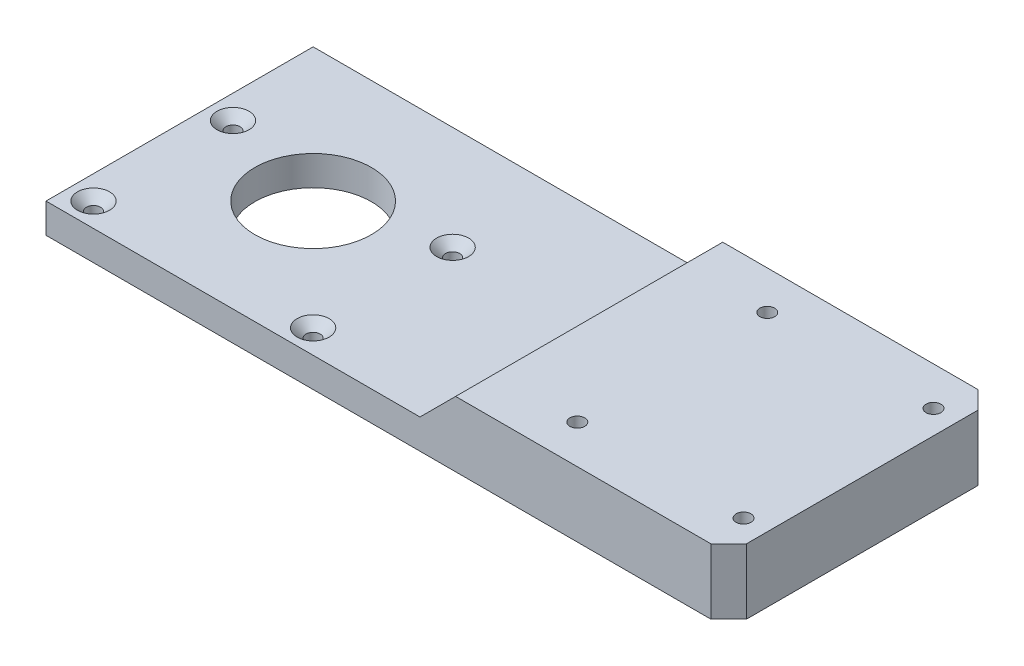
ISO-10303-21;
HEADER;
FILE_DESCRIPTION(('STEP AP214'),'2;1');
FILE_NAME('part.step','',(''),(''),'','','');
FILE_SCHEMA(('AUTOMOTIVE_DESIGN { 1 0 10303 214 1 1 1 1 }'));
ENDSEC;
DATA;
#1=APPLICATION_CONTEXT('core data for automotive mechanical design processes');
#2=APPLICATION_PROTOCOL_DEFINITION('international standard','automotive_design',2000,#1);
#3=PRODUCT_CONTEXT('',#1,'mechanical');
#4=PRODUCT('Part','Part','',(#3));
#5=PRODUCT_RELATED_PRODUCT_CATEGORY('part','',(#4));
#6=PRODUCT_DEFINITION_FORMATION('','',#4);
#7=PRODUCT_DEFINITION_CONTEXT('part definition',#1,'design');
#8=PRODUCT_DEFINITION('design','',#6,#7);
#9=PRODUCT_DEFINITION_SHAPE('','',#8);
#10=(LENGTH_UNIT() NAMED_UNIT(*) SI_UNIT(.MILLI.,.METRE.));
#11=(NAMED_UNIT(*) PLANE_ANGLE_UNIT() SI_UNIT($,.RADIAN.));
#12=(NAMED_UNIT(*) SI_UNIT($,.STERADIAN.) SOLID_ANGLE_UNIT());
#13=UNCERTAINTY_MEASURE_WITH_UNIT(LENGTH_MEASURE(1.E-05),#10,'distance_accuracy_value','');
#14=(GEOMETRIC_REPRESENTATION_CONTEXT(3) GLOBAL_UNCERTAINTY_ASSIGNED_CONTEXT((#13)) GLOBAL_UNIT_ASSIGNED_CONTEXT((#10,
#11,#12)) REPRESENTATION_CONTEXT('',''));
#15=CARTESIAN_POINT('',(0.,0.,0.));
#16=DIRECTION('',(0.,0.,1.));
#17=DIRECTION('',(1.,0.,0.));
#18=AXIS2_PLACEMENT_3D('',#15,#16,#17);
#19=CARTESIAN_POINT('',(0.,11.,0.));
#20=DIRECTION('',(0.,-1.,0.));
#21=DIRECTION('',(0.,0.,-1.));
#22=AXIS2_PLACEMENT_3D('',#19,#20,#21);
#23=PLANE('',#22);
#24=CARTESIAN_POINT('',(83.,11.,-16.));
#25=DIRECTION('',(0.,1.,0.));
#26=DIRECTION('',(0.,0.,1.));
#27=AXIS2_PLACEMENT_3D('',#24,#25,#26);
#28=CIRCLE('',#27,1.24999999999999);
#29=CARTESIAN_POINT('',(83.,11.,-14.75));
#30=VERTEX_POINT('',#29);
#31=EDGE_CURVE('E355',#30,#30,#28,.T.);
#32=ORIENTED_EDGE('',*,*,#31,.F.);
#33=EDGE_LOOP('',(#32));
#34=FACE_BOUND('',#33,.T.);
#35=CARTESIAN_POINT('',(111.,11.,-16.));
#36=DIRECTION('',(0.,1.,0.));
#37=DIRECTION('',(0.,0.,1.));
#38=AXIS2_PLACEMENT_3D('',#35,#36,#37);
#39=CIRCLE('',#38,1.24999999999999);
#40=CARTESIAN_POINT('',(111.,11.,-14.75));
#41=VERTEX_POINT('',#40);
#42=EDGE_CURVE('E351',#41,#41,#39,.T.);
#43=ORIENTED_EDGE('',*,*,#42,.F.);
#44=EDGE_LOOP('',(#43));
#45=FACE_BOUND('',#44,.T.);
#46=CARTESIAN_POINT('',(111.,11.,16.));
#47=DIRECTION('',(0.,1.,0.));
#48=DIRECTION('',(0.,0.,1.));
#49=AXIS2_PLACEMENT_3D('',#46,#47,#48);
#50=CIRCLE('',#49,1.24999999999999);
#51=CARTESIAN_POINT('',(111.,11.,17.25));
#52=VERTEX_POINT('',#51);
#53=EDGE_CURVE('E134',#52,#52,#50,.T.);
#54=ORIENTED_EDGE('',*,*,#53,.F.);
#55=EDGE_LOOP('',(#54));
#56=FACE_BOUND('',#55,.T.);
#57=DIRECTION('',(0.,0.,-1.));
#58=VECTOR('',#57,1.);
#59=CARTESIAN_POINT('',(115.,11.,-22.5));
#60=LINE('',#59,#58);
#61=CARTESIAN_POINT('',(115.,11.,19.5));
#62=VERTEX_POINT('',#61);
#63=CARTESIAN_POINT('',(115.,11.,-19.5));
#64=VERTEX_POINT('',#63);
#65=EDGE_CURVE('E128',#62,#64,#60,.T.);
#66=ORIENTED_EDGE('',*,*,#65,.T.);
#67=DIRECTION('',(-0.707106781186546,0.,-0.707106781186549));
#68=VECTOR('',#67,1.);
#69=CARTESIAN_POINT('',(112.,11.,-22.5));
#70=LINE('',#69,#68);
#71=CARTESIAN_POINT('',(112.,11.,-22.5));
#72=VERTEX_POINT('',#71);
#73=EDGE_CURVE('E44',#64,#72,#70,.T.);
#74=ORIENTED_EDGE('',*,*,#73,.T.);
#75=DIRECTION('',(-1.,0.,0.));
#76=VECTOR('',#75,1.);
#77=CARTESIAN_POINT('',(115.,11.,-22.5));
#78=LINE('',#77,#76);
#79=CARTESIAN_POINT('',(69.,11.,-22.5));
#80=VERTEX_POINT('',#79);
#81=EDGE_CURVE('E131',#72,#80,#78,.T.);
#82=ORIENTED_EDGE('',*,*,#81,.T.);
#83=DIRECTION('',(0.,0.,1.));
#84=VECTOR('',#83,1.);
#85=CARTESIAN_POINT('',(69.,11.,0.));
#86=LINE('',#85,#84);
#87=CARTESIAN_POINT('',(69.,11.,22.5));
#88=VERTEX_POINT('',#87);
#89=EDGE_CURVE('E112',#80,#88,#86,.T.);
#90=ORIENTED_EDGE('',*,*,#89,.T.);
#91=DIRECTION('',(1.,0.,0.));
#92=VECTOR('',#91,1.);
#93=CARTESIAN_POINT('',(115.,11.,22.5));
#94=LINE('',#93,#92);
#95=CARTESIAN_POINT('',(112.,11.,22.5));
#96=VERTEX_POINT('',#95);
#97=EDGE_CURVE('E106',#88,#96,#94,.T.);
#98=ORIENTED_EDGE('',*,*,#97,.T.);
#99=DIRECTION('',(-0.707106781186549,0.,0.707106781186546));
#100=VECTOR('',#99,1.);
#101=CARTESIAN_POINT('',(115.,11.,19.5));
#102=LINE('',#101,#100);
#103=EDGE_CURVE('E209',#96,#62,#102,.F.);
#104=ORIENTED_EDGE('',*,*,#103,.T.);
#105=EDGE_LOOP('',(#66,#74,#82,#90,#98,#104));
#106=FACE_BOUND('',#105,.T.);
#107=CARTESIAN_POINT('',(83.,11.,16.));
#108=DIRECTION('',(0.,1.,0.));
#109=DIRECTION('',(0.,0.,1.));
#110=AXIS2_PLACEMENT_3D('',#107,#108,#109);
#111=CIRCLE('',#110,1.24999999999999);
#112=CARTESIAN_POINT('',(83.,11.,17.25));
#113=VERTEX_POINT('',#112);
#114=EDGE_CURVE('E345',#113,#113,#111,.T.);
#115=ORIENTED_EDGE('',*,*,#114,.F.);
#116=EDGE_LOOP('',(#115));
#117=FACE_BOUND('',#116,.T.);
#118=ADVANCED_FACE('F36',(#34,#45,#56,#106,#117),#23,.F.);
#119=CARTESIAN_POINT('',(0.,5.,22.5));
#120=DIRECTION('',(0.,0.,-1.));
#121=DIRECTION('',(-1.,0.,0.));
#122=AXIS2_PLACEMENT_3D('',#119,#120,#121);
#123=PLANE('',#122);
#124=DIRECTION('',(1.,0.,0.));
#125=VECTOR('',#124,1.);
#126=CARTESIAN_POINT('',(0.,0.,22.5));
#127=LINE('',#126,#125);
#128=CARTESIAN_POINT('',(0.,0.,22.5));
#129=VERTEX_POINT('',#128);
#130=CARTESIAN_POINT('',(112.,0.,22.5));
#131=VERTEX_POINT('',#130);
#132=EDGE_CURVE('E180',#129,#131,#127,.T.);
#133=ORIENTED_EDGE('',*,*,#132,.T.);
#134=DIRECTION('',(0.,1.,0.));
#135=VECTOR('',#134,1.);
#136=CARTESIAN_POINT('',(112.,5.,22.5));
#137=LINE('',#136,#135);
#138=EDGE_CURVE('E11',#131,#96,#137,.T.);
#139=ORIENTED_EDGE('',*,*,#138,.T.);
#140=ORIENTED_EDGE('',*,*,#97,.F.);
#141=DIRECTION('',(0.707106781186546,0.707106781186549,0.));
#142=VECTOR('',#141,1.);
#143=CARTESIAN_POINT('',(69.,11.,22.5));
#144=LINE('',#143,#142);
#145=CARTESIAN_POINT('',(63.,5.,22.5));
#146=VERTEX_POINT('',#145);
#147=EDGE_CURVE('E101',#88,#146,#144,.F.);
#148=ORIENTED_EDGE('',*,*,#147,.T.);
#149=DIRECTION('',(1.,0.,0.));
#150=VECTOR('',#149,1.);
#151=CARTESIAN_POINT('',(0.,5.,22.5));
#152=LINE('',#151,#150);
#153=CARTESIAN_POINT('',(0.,5.,22.5));
#154=VERTEX_POINT('',#153);
#155=EDGE_CURVE('E104',#154,#146,#152,.T.);
#156=ORIENTED_EDGE('',*,*,#155,.F.);
#157=DIRECTION('',(0.,-1.,0.));
#158=VECTOR('',#157,1.);
#159=CARTESIAN_POINT('',(0.,5.,22.5));
#160=LINE('',#159,#158);
#161=EDGE_CURVE('E184',#154,#129,#160,.T.);
#162=ORIENTED_EDGE('',*,*,#161,.T.);
#163=EDGE_LOOP('',(#133,#139,#140,#148,#156,#162));
#164=FACE_BOUND('',#163,.T.);
#165=ADVANCED_FACE('F103',(#164),#123,.F.);
#166=CARTESIAN_POINT('',(115.,5.,22.5));
#167=DIRECTION('',(-1.,0.,0.));
#168=DIRECTION('',(0.,0.,1.));
#169=AXIS2_PLACEMENT_3D('',#166,#167,#168);
#170=PLANE('',#169);
#171=DIRECTION('',(0.,0.,-1.));
#172=VECTOR('',#171,1.);
#173=CARTESIAN_POINT('',(115.,0.,22.5));
#174=LINE('',#173,#172);
#175=CARTESIAN_POINT('',(115.,0.,19.5));
#176=VERTEX_POINT('',#175);
#177=CARTESIAN_POINT('',(115.,0.,-19.5));
#178=VERTEX_POINT('',#177);
#179=EDGE_CURVE('E186',#176,#178,#174,.T.);
#180=ORIENTED_EDGE('',*,*,#179,.T.);
#181=DIRECTION('',(0.,1.,0.));
#182=VECTOR('',#181,1.);
#183=CARTESIAN_POINT('',(115.,11.,-19.5));
#184=LINE('',#183,#182);
#185=EDGE_CURVE('E57',#178,#64,#184,.T.);
#186=ORIENTED_EDGE('',*,*,#185,.T.);
#187=ORIENTED_EDGE('',*,*,#65,.F.);
#188=DIRECTION('',(0.,-1.,0.));
#189=VECTOR('',#188,1.);
#190=CARTESIAN_POINT('',(115.,5.,19.5));
#191=LINE('',#190,#189);
#192=EDGE_CURVE('E205',#62,#176,#191,.T.);
#193=ORIENTED_EDGE('',*,*,#192,.T.);
#194=EDGE_LOOP('',(#180,#186,#187,#193));
#195=FACE_BOUND('',#194,.T.);
#196=ADVANCED_FACE('F223',(#195),#170,.F.);
#197=CARTESIAN_POINT('',(0.,5.,-22.5));
#198=DIRECTION('',(0.,0.,-1.));
#199=DIRECTION('',(-1.,0.,0.));
#200=AXIS2_PLACEMENT_3D('',#197,#198,#199);
#201=PLANE('',#200);
#202=ORIENTED_EDGE('',*,*,#81,.F.);
#203=DIRECTION('',(0.,-1.,0.));
#204=VECTOR('',#203,1.);
#205=CARTESIAN_POINT('',(112.,0.,-22.5));
#206=LINE('',#205,#204);
#207=CARTESIAN_POINT('',(112.,0.,-22.5));
#208=VERTEX_POINT('',#207);
#209=EDGE_CURVE('E198',#72,#208,#206,.T.);
#210=ORIENTED_EDGE('',*,*,#209,.T.);
#211=DIRECTION('',(1.,0.,0.));
#212=VECTOR('',#211,1.);
#213=CARTESIAN_POINT('',(0.,0.,-22.5));
#214=LINE('',#213,#212);
#215=CARTESIAN_POINT('',(0.,0.,-22.5));
#216=VERTEX_POINT('',#215);
#217=EDGE_CURVE('E188',#216,#208,#214,.T.);
#218=ORIENTED_EDGE('',*,*,#217,.F.);
#219=DIRECTION('',(0.,-1.,0.));
#220=VECTOR('',#219,1.);
#221=CARTESIAN_POINT('',(0.,5.,-22.5));
#222=LINE('',#221,#220);
#223=CARTESIAN_POINT('',(0.,5.,-22.5));
#224=VERTEX_POINT('',#223);
#225=EDGE_CURVE('E194',#224,#216,#222,.T.);
#226=ORIENTED_EDGE('',*,*,#225,.F.);
#227=DIRECTION('',(1.,0.,0.));
#228=VECTOR('',#227,1.);
#229=CARTESIAN_POINT('',(0.,5.,-22.5));
#230=LINE('',#229,#228);
#231=CARTESIAN_POINT('',(63.,5.,-22.5));
#232=VERTEX_POINT('',#231);
#233=EDGE_CURVE('E122',#224,#232,#230,.T.);
#234=ORIENTED_EDGE('',*,*,#233,.T.);
#235=DIRECTION('',(-0.707106781186546,-0.707106781186549,0.));
#236=VECTOR('',#235,1.);
#237=CARTESIAN_POINT('',(31.5000000000002,-26.5,-22.5));
#238=LINE('',#237,#236);
#239=EDGE_CURVE('E111',#232,#80,#238,.F.);
#240=ORIENTED_EDGE('',*,*,#239,.T.);
#241=EDGE_LOOP('',(#202,#210,#218,#226,#234,#240));
#242=FACE_BOUND('',#241,.T.);
#243=ADVANCED_FACE('F217',(#242),#201,.T.);
#244=CARTESIAN_POINT('',(0.,5.,22.5));
#245=DIRECTION('',(-1.,0.,0.));
#246=DIRECTION('',(0.,0.,1.));
#247=AXIS2_PLACEMENT_3D('',#244,#245,#246);
#248=PLANE('',#247);
#249=DIRECTION('',(0.,0.,-1.));
#250=VECTOR('',#249,1.);
#251=CARTESIAN_POINT('',(0.,0.,22.5));
#252=LINE('',#251,#250);
#253=EDGE_CURVE('E123',#129,#216,#252,.T.);
#254=ORIENTED_EDGE('',*,*,#253,.F.);
#255=ORIENTED_EDGE('',*,*,#161,.F.);
#256=DIRECTION('',(0.,0.,-1.));
#257=VECTOR('',#256,1.);
#258=CARTESIAN_POINT('',(0.,5.,22.5));
#259=LINE('',#258,#257);
#260=EDGE_CURVE('E121',#154,#224,#259,.T.);
#261=ORIENTED_EDGE('',*,*,#260,.T.);
#262=ORIENTED_EDGE('',*,*,#225,.T.);
#263=EDGE_LOOP('',(#254,#255,#261,#262));
#264=FACE_BOUND('',#263,.T.);
#265=ADVANCED_FACE('F230',(#264),#248,.T.);
#266=CARTESIAN_POINT('',(0.,5.,0.));
#267=DIRECTION('',(0.,1.,0.));
#268=DIRECTION('',(0.,0.,1.));
#269=AXIS2_PLACEMENT_3D('',#266,#267,#268);
#270=PLANE('',#269);
#271=DIRECTION('',(0.,0.,1.));
#272=VECTOR('',#271,1.);
#273=CARTESIAN_POINT('',(63.,5.,-22.5));
#274=LINE('',#273,#272);
#275=EDGE_CURVE('E118',#232,#146,#274,.T.);
#276=ORIENTED_EDGE('',*,*,#275,.F.);
#277=ORIENTED_EDGE('',*,*,#233,.F.);
#278=ORIENTED_EDGE('',*,*,#260,.F.);
#279=ORIENTED_EDGE('',*,*,#155,.T.);
#280=EDGE_LOOP('',(#276,#277,#278,#279));
#281=FACE_BOUND('',#280,.T.);
#282=CARTESIAN_POINT('',(4.,5.,18.5));
#283=DIRECTION('',(0.,1.,0.));
#284=DIRECTION('',(0.,0.,1.));
#285=AXIS2_PLACEMENT_3D('',#282,#283,#284);
#286=CIRCLE('',#285,2.7);
#287=CARTESIAN_POINT('',(4.,5.,21.2));
#288=VERTEX_POINT('',#287);
#289=EDGE_CURVE('E139',#288,#288,#286,.T.);
#290=ORIENTED_EDGE('',*,*,#289,.F.);
#291=EDGE_LOOP('',(#290));
#292=FACE_BOUND('',#291,.T.);
#293=CARTESIAN_POINT('',(41.,5.,18.5));
#294=DIRECTION('',(0.,1.,0.));
#295=DIRECTION('',(0.,0.,1.));
#296=AXIS2_PLACEMENT_3D('',#293,#294,#295);
#297=CIRCLE('',#296,2.7);
#298=CARTESIAN_POINT('',(41.,5.,21.2));
#299=VERTEX_POINT('',#298);
#300=EDGE_CURVE('E148',#299,#299,#297,.T.);
#301=ORIENTED_EDGE('',*,*,#300,.F.);
#302=EDGE_LOOP('',(#301));
#303=FACE_BOUND('',#302,.T.);
#304=CARTESIAN_POINT('',(41.,5.,-5.));
#305=DIRECTION('',(0.,1.,0.));
#306=DIRECTION('',(0.,0.,1.));
#307=AXIS2_PLACEMENT_3D('',#304,#305,#306);
#308=CIRCLE('',#307,2.7);
#309=CARTESIAN_POINT('',(41.,5.,-2.3));
#310=VERTEX_POINT('',#309);
#311=EDGE_CURVE('E157',#310,#310,#308,.T.);
#312=ORIENTED_EDGE('',*,*,#311,.F.);
#313=EDGE_LOOP('',(#312));
#314=FACE_BOUND('',#313,.T.);
#315=CARTESIAN_POINT('',(4.,5.,-5.));
#316=DIRECTION('',(0.,1.,0.));
#317=DIRECTION('',(0.,0.,1.));
#318=AXIS2_PLACEMENT_3D('',#315,#316,#317);
#319=CIRCLE('',#318,2.7);
#320=CARTESIAN_POINT('',(4.,5.,-2.3));
#321=VERTEX_POINT('',#320);
#322=EDGE_CURVE('E166',#321,#321,#319,.T.);
#323=ORIENTED_EDGE('',*,*,#322,.F.);
#324=EDGE_LOOP('',(#323));
#325=FACE_BOUND('',#324,.T.);
#326=CARTESIAN_POINT('',(22.5,5.,0.));
#327=DIRECTION('',(0.,1.,0.));
#328=DIRECTION('',(0.,0.,1.));
#329=AXIS2_PLACEMENT_3D('',#326,#327,#328);
#330=CIRCLE('',#329,9.81710000000001);
#331=CARTESIAN_POINT('',(22.5,5.,9.81710000000001));
#332=VERTEX_POINT('',#331);
#333=EDGE_CURVE('E175',#332,#332,#330,.T.);
#334=ORIENTED_EDGE('',*,*,#333,.F.);
#335=EDGE_LOOP('',(#334));
#336=FACE_BOUND('',#335,.T.);
#337=ADVANCED_FACE('F115',(#281,#292,#303,#314,#325,#336),#270,.T.);
#338=CARTESIAN_POINT('',(0.,0.,0.));
#339=DIRECTION('',(0.,1.,0.));
#340=DIRECTION('',(0.,0.,1.));
#341=AXIS2_PLACEMENT_3D('',#338,#339,#340);
#342=PLANE('',#341);
#343=CARTESIAN_POINT('',(83.,0.,-16.));
#344=DIRECTION('',(0.,1.,0.));
#345=DIRECTION('',(0.,0.,1.));
#346=AXIS2_PLACEMENT_3D('',#343,#344,#345);
#347=CIRCLE('',#346,1.25);
#348=CARTESIAN_POINT('',(83.,0.,-14.75));
#349=VERTEX_POINT('',#348);
#350=EDGE_CURVE('E295',#349,#349,#347,.T.);
#351=ORIENTED_EDGE('',*,*,#350,.T.);
#352=EDGE_LOOP('',(#351));
#353=FACE_BOUND('',#352,.T.);
#354=CARTESIAN_POINT('',(111.,0.,-16.));
#355=DIRECTION('',(0.,1.,0.));
#356=DIRECTION('',(0.,0.,1.));
#357=AXIS2_PLACEMENT_3D('',#354,#355,#356);
#358=CIRCLE('',#357,1.25);
#359=CARTESIAN_POINT('',(111.,0.,-14.75));
#360=VERTEX_POINT('',#359);
#361=EDGE_CURVE('E299',#360,#360,#358,.T.);
#362=ORIENTED_EDGE('',*,*,#361,.T.);
#363=EDGE_LOOP('',(#362));
#364=FACE_BOUND('',#363,.T.);
#365=CARTESIAN_POINT('',(83.,0.,16.));
#366=DIRECTION('',(0.,1.,0.));
#367=DIRECTION('',(0.,0.,1.));
#368=AXIS2_PLACEMENT_3D('',#365,#366,#367);
#369=CIRCLE('',#368,1.25);
#370=CARTESIAN_POINT('',(83.,0.,17.25));
#371=VERTEX_POINT('',#370);
#372=EDGE_CURVE('E303',#371,#371,#369,.T.);
#373=ORIENTED_EDGE('',*,*,#372,.T.);
#374=EDGE_LOOP('',(#373));
#375=FACE_BOUND('',#374,.T.);
#376=CARTESIAN_POINT('',(111.,0.,16.));
#377=DIRECTION('',(0.,1.,0.));
#378=DIRECTION('',(0.,0.,1.));
#379=AXIS2_PLACEMENT_3D('',#376,#377,#378);
#380=CIRCLE('',#379,1.25);
#381=CARTESIAN_POINT('',(111.,0.,17.25));
#382=VERTEX_POINT('',#381);
#383=EDGE_CURVE('E129',#382,#382,#380,.T.);
#384=ORIENTED_EDGE('',*,*,#383,.T.);
#385=EDGE_LOOP('',(#384));
#386=FACE_BOUND('',#385,.T.);
#387=CARTESIAN_POINT('',(4.,0.,18.5));
#388=DIRECTION('',(0.,1.,0.));
#389=DIRECTION('',(0.,0.,1.));
#390=AXIS2_PLACEMENT_3D('',#387,#388,#389);
#391=CIRCLE('',#390,1.19999999999999);
#392=CARTESIAN_POINT('',(4.,0.,19.7));
#393=VERTEX_POINT('',#392);
#394=EDGE_CURVE('E145',#393,#393,#391,.T.);
#395=ORIENTED_EDGE('',*,*,#394,.T.);
#396=EDGE_LOOP('',(#395));
#397=FACE_BOUND('',#396,.T.);
#398=CARTESIAN_POINT('',(41.,0.,18.5));
#399=DIRECTION('',(0.,1.,0.));
#400=DIRECTION('',(0.,0.,1.));
#401=AXIS2_PLACEMENT_3D('',#398,#399,#400);
#402=CIRCLE('',#401,1.19999999999999);
#403=CARTESIAN_POINT('',(41.,0.,19.7));
#404=VERTEX_POINT('',#403);
#405=EDGE_CURVE('E154',#404,#404,#402,.T.);
#406=ORIENTED_EDGE('',*,*,#405,.T.);
#407=EDGE_LOOP('',(#406));
#408=FACE_BOUND('',#407,.T.);
#409=CARTESIAN_POINT('',(41.,0.,-5.));
#410=DIRECTION('',(0.,1.,0.));
#411=DIRECTION('',(0.,0.,1.));
#412=AXIS2_PLACEMENT_3D('',#409,#410,#411);
#413=CIRCLE('',#412,1.19999999999999);
#414=CARTESIAN_POINT('',(41.,0.,-3.80000000000002));
#415=VERTEX_POINT('',#414);
#416=EDGE_CURVE('E163',#415,#415,#413,.T.);
#417=ORIENTED_EDGE('',*,*,#416,.T.);
#418=EDGE_LOOP('',(#417));
#419=FACE_BOUND('',#418,.T.);
#420=CARTESIAN_POINT('',(4.,0.,-5.));
#421=DIRECTION('',(0.,1.,0.));
#422=DIRECTION('',(0.,0.,1.));
#423=AXIS2_PLACEMENT_3D('',#420,#421,#422);
#424=CIRCLE('',#423,1.19999999999999);
#425=CARTESIAN_POINT('',(4.,0.,-3.80000000000001));
#426=VERTEX_POINT('',#425);
#427=EDGE_CURVE('E172',#426,#426,#424,.T.);
#428=ORIENTED_EDGE('',*,*,#427,.T.);
#429=EDGE_LOOP('',(#428));
#430=FACE_BOUND('',#429,.T.);
#431=CARTESIAN_POINT('',(22.5,0.,0.));
#432=DIRECTION('',(0.,1.,0.));
#433=DIRECTION('',(0.,0.,1.));
#434=AXIS2_PLACEMENT_3D('',#431,#432,#433);
#435=CIRCLE('',#434,9.81710000000001);
#436=CARTESIAN_POINT('',(22.5,0.,9.81710000000001));
#437=VERTEX_POINT('',#436);
#438=EDGE_CURVE('E178',#437,#437,#435,.F.);
#439=ORIENTED_EDGE('',*,*,#438,.F.);
#440=EDGE_LOOP('',(#439));
#441=FACE_BOUND('',#440,.T.);
#442=ORIENTED_EDGE('',*,*,#217,.T.);
#443=DIRECTION('',(0.707106781186546,0.,0.707106781186549));
#444=VECTOR('',#443,1.);
#445=CARTESIAN_POINT('',(112.,0.,-22.5));
#446=LINE('',#445,#444);
#447=EDGE_CURVE('E203',#208,#178,#446,.T.);
#448=ORIENTED_EDGE('',*,*,#447,.T.);
#449=ORIENTED_EDGE('',*,*,#179,.F.);
#450=DIRECTION('',(0.707106781186549,0.,-0.707106781186546));
#451=VECTOR('',#450,1.);
#452=CARTESIAN_POINT('',(115.,0.,19.5));
#453=LINE('',#452,#451);
#454=EDGE_CURVE('E201',#176,#131,#453,.F.);
#455=ORIENTED_EDGE('',*,*,#454,.T.);
#456=ORIENTED_EDGE('',*,*,#132,.F.);
#457=ORIENTED_EDGE('',*,*,#253,.T.);
#458=EDGE_LOOP('',(#442,#448,#449,#455,#456,#457));
#459=FACE_BOUND('',#458,.T.);
#460=ADVANCED_FACE('F222',(#353,#364,#375,#386,#397,#408,#419,#430,#441,#459),#342,.F.);
#461=CARTESIAN_POINT('',(22.5,-0.00100000000000013,0.));
#462=DIRECTION('',(0.,1.,0.));
#463=DIRECTION('',(0.,0.,1.));
#464=AXIS2_PLACEMENT_3D('',#461,#462,#463);
#465=CYLINDRICAL_SURFACE('',#464,9.81710000000001);
#466=ORIENTED_EDGE('',*,*,#333,.T.);
#467=EDGE_LOOP('',(#466));
#468=FACE_BOUND('',#467,.T.);
#469=ORIENTED_EDGE('',*,*,#438,.T.);
#470=EDGE_LOOP('',(#469));
#471=FACE_BOUND('',#470,.T.);
#472=ADVANCED_FACE('F284',(#468,#471),#465,.F.);
#473=CARTESIAN_POINT('',(4.,5.,-5.));
#474=DIRECTION('',(0.,1.,0.));
#475=DIRECTION('',(0.,0.,1.));
#476=AXIS2_PLACEMENT_3D('',#473,#474,#475);
#477=CYLINDRICAL_SURFACE('',#476,1.19999999999999);
#478=ORIENTED_EDGE('',*,*,#427,.F.);
#479=EDGE_LOOP('',(#478));
#480=FACE_BOUND('',#479,.T.);
#481=CARTESIAN_POINT('',(4.,3.5,-5.));
#482=DIRECTION('',(0.,1.,0.));
#483=DIRECTION('',(0.,0.,1.));
#484=AXIS2_PLACEMENT_3D('',#481,#482,#483);
#485=CIRCLE('',#484,1.2);
#486=CARTESIAN_POINT('',(4.,3.5,-3.8));
#487=VERTEX_POINT('',#486);
#488=EDGE_CURVE('E169',#487,#487,#485,.T.);
#489=ORIENTED_EDGE('',*,*,#488,.T.);
#490=EDGE_LOOP('',(#489));
#491=FACE_BOUND('',#490,.T.);
#492=ADVANCED_FACE('F280',(#480,#491),#477,.F.);
#493=CARTESIAN_POINT('',(4.,5.,-5.));
#494=DIRECTION('',(0.,1.,0.));
#495=DIRECTION('',(0.,0.,1.));
#496=AXIS2_PLACEMENT_3D('',#493,#494,#495);
#497=CONICAL_SURFACE('',#496,2.7,0.785398163397448);
#498=ORIENTED_EDGE('',*,*,#488,.F.);
#499=EDGE_LOOP('',(#498));
#500=FACE_BOUND('',#499,.T.);
#501=ORIENTED_EDGE('',*,*,#322,.T.);
#502=EDGE_LOOP('',(#501));
#503=FACE_BOUND('',#502,.T.);
#504=ADVANCED_FACE('F276',(#500,#503),#497,.F.);
#505=CARTESIAN_POINT('',(41.,5.,-5.));
#506=DIRECTION('',(0.,1.,0.));
#507=DIRECTION('',(0.,0.,1.));
#508=AXIS2_PLACEMENT_3D('',#505,#506,#507);
#509=CYLINDRICAL_SURFACE('',#508,1.19999999999999);
#510=ORIENTED_EDGE('',*,*,#416,.F.);
#511=EDGE_LOOP('',(#510));
#512=FACE_BOUND('',#511,.T.);
#513=CARTESIAN_POINT('',(41.,3.5,-5.));
#514=DIRECTION('',(0.,1.,0.));
#515=DIRECTION('',(0.,0.,1.));
#516=AXIS2_PLACEMENT_3D('',#513,#514,#515);
#517=CIRCLE('',#516,1.2);
#518=CARTESIAN_POINT('',(41.,3.5,-3.8));
#519=VERTEX_POINT('',#518);
#520=EDGE_CURVE('E160',#519,#519,#517,.T.);
#521=ORIENTED_EDGE('',*,*,#520,.T.);
#522=EDGE_LOOP('',(#521));
#523=FACE_BOUND('',#522,.T.);
#524=ADVANCED_FACE('F272',(#512,#523),#509,.F.);
#525=CARTESIAN_POINT('',(41.,5.,-5.));
#526=DIRECTION('',(0.,1.,0.));
#527=DIRECTION('',(0.,0.,1.));
#528=AXIS2_PLACEMENT_3D('',#525,#526,#527);
#529=CONICAL_SURFACE('',#528,2.7,0.785398163397448);
#530=ORIENTED_EDGE('',*,*,#520,.F.);
#531=EDGE_LOOP('',(#530));
#532=FACE_BOUND('',#531,.T.);
#533=ORIENTED_EDGE('',*,*,#311,.T.);
#534=EDGE_LOOP('',(#533));
#535=FACE_BOUND('',#534,.T.);
#536=ADVANCED_FACE('F268',(#532,#535),#529,.F.);
#537=CARTESIAN_POINT('',(41.,5.,18.5));
#538=DIRECTION('',(0.,1.,0.));
#539=DIRECTION('',(0.,0.,1.));
#540=AXIS2_PLACEMENT_3D('',#537,#538,#539);
#541=CYLINDRICAL_SURFACE('',#540,1.19999999999999);
#542=ORIENTED_EDGE('',*,*,#405,.F.);
#543=EDGE_LOOP('',(#542));
#544=FACE_BOUND('',#543,.T.);
#545=CARTESIAN_POINT('',(41.,3.5,18.5));
#546=DIRECTION('',(0.,1.,0.));
#547=DIRECTION('',(0.,0.,1.));
#548=AXIS2_PLACEMENT_3D('',#545,#546,#547);
#549=CIRCLE('',#548,1.2);
#550=CARTESIAN_POINT('',(41.,3.5,19.7));
#551=VERTEX_POINT('',#550);
#552=EDGE_CURVE('E151',#551,#551,#549,.T.);
#553=ORIENTED_EDGE('',*,*,#552,.T.);
#554=EDGE_LOOP('',(#553));
#555=FACE_BOUND('',#554,.T.);
#556=ADVANCED_FACE('F264',(#544,#555),#541,.F.);
#557=CARTESIAN_POINT('',(41.,5.,18.5));
#558=DIRECTION('',(0.,1.,0.));
#559=DIRECTION('',(0.,0.,1.));
#560=AXIS2_PLACEMENT_3D('',#557,#558,#559);
#561=CONICAL_SURFACE('',#560,2.7,0.785398163397448);
#562=ORIENTED_EDGE('',*,*,#552,.F.);
#563=EDGE_LOOP('',(#562));
#564=FACE_BOUND('',#563,.T.);
#565=ORIENTED_EDGE('',*,*,#300,.T.);
#566=EDGE_LOOP('',(#565));
#567=FACE_BOUND('',#566,.T.);
#568=ADVANCED_FACE('F260',(#564,#567),#561,.F.);
#569=CARTESIAN_POINT('',(4.,5.,18.5));
#570=DIRECTION('',(0.,1.,0.));
#571=DIRECTION('',(0.,0.,1.));
#572=AXIS2_PLACEMENT_3D('',#569,#570,#571);
#573=CYLINDRICAL_SURFACE('',#572,1.19999999999999);
#574=ORIENTED_EDGE('',*,*,#394,.F.);
#575=EDGE_LOOP('',(#574));
#576=FACE_BOUND('',#575,.T.);
#577=CARTESIAN_POINT('',(4.,3.5,18.5));
#578=DIRECTION('',(0.,1.,0.));
#579=DIRECTION('',(0.,0.,1.));
#580=AXIS2_PLACEMENT_3D('',#577,#578,#579);
#581=CIRCLE('',#580,1.2);
#582=CARTESIAN_POINT('',(4.,3.5,19.7));
#583=VERTEX_POINT('',#582);
#584=EDGE_CURVE('E142',#583,#583,#581,.T.);
#585=ORIENTED_EDGE('',*,*,#584,.T.);
#586=EDGE_LOOP('',(#585));
#587=FACE_BOUND('',#586,.T.);
#588=ADVANCED_FACE('F256',(#576,#587),#573,.F.);
#589=CARTESIAN_POINT('',(4.,5.,18.5));
#590=DIRECTION('',(0.,1.,0.));
#591=DIRECTION('',(0.,0.,1.));
#592=AXIS2_PLACEMENT_3D('',#589,#590,#591);
#593=CONICAL_SURFACE('',#592,2.7,0.785398163397448);
#594=ORIENTED_EDGE('',*,*,#584,.F.);
#595=EDGE_LOOP('',(#594));
#596=FACE_BOUND('',#595,.T.);
#597=ORIENTED_EDGE('',*,*,#289,.T.);
#598=EDGE_LOOP('',(#597));
#599=FACE_BOUND('',#598,.T.);
#600=ADVANCED_FACE('F253',(#596,#599),#593,.F.);
#601=CARTESIAN_POINT('',(69.,11.,0.));
#602=DIRECTION('',(0.707106781186549,-0.707106781186546,0.));
#603=DIRECTION('',(0.,0.,1.));
#604=AXIS2_PLACEMENT_3D('',#601,#602,#603);
#605=PLANE('',#604);
#606=ORIENTED_EDGE('',*,*,#239,.F.);
#607=ORIENTED_EDGE('',*,*,#275,.T.);
#608=ORIENTED_EDGE('',*,*,#147,.F.);
#609=ORIENTED_EDGE('',*,*,#89,.F.);
#610=EDGE_LOOP('',(#606,#607,#608,#609));
#611=FACE_BOUND('',#610,.T.);
#612=ADVANCED_FACE('F126',(#611),#605,.F.);
#613=CARTESIAN_POINT('',(111.,11.,16.));
#614=DIRECTION('',(0.,1.,0.));
#615=DIRECTION('',(0.,0.,1.));
#616=AXIS2_PLACEMENT_3D('',#613,#614,#615);
#617=CYLINDRICAL_SURFACE('',#616,1.24999999999999);
#618=ORIENTED_EDGE('',*,*,#383,.F.);
#619=EDGE_LOOP('',(#618));
#620=FACE_BOUND('',#619,.T.);
#621=ORIENTED_EDGE('',*,*,#53,.T.);
#622=EDGE_LOOP('',(#621));
#623=FACE_BOUND('',#622,.T.);
#624=ADVANCED_FACE('F251',(#620,#623),#617,.F.);
#625=CARTESIAN_POINT('',(83.,11.,16.));
#626=DIRECTION('',(0.,1.,0.));
#627=DIRECTION('',(0.,0.,1.));
#628=AXIS2_PLACEMENT_3D('',#625,#626,#627);
#629=CYLINDRICAL_SURFACE('',#628,1.24999999999999);
#630=ORIENTED_EDGE('',*,*,#372,.F.);
#631=EDGE_LOOP('',(#630));
#632=FACE_BOUND('',#631,.T.);
#633=ORIENTED_EDGE('',*,*,#114,.T.);
#634=EDGE_LOOP('',(#633));
#635=FACE_BOUND('',#634,.T.);
#636=ADVANCED_FACE('F340',(#632,#635),#629,.F.);
#637=CARTESIAN_POINT('',(111.,11.,-16.));
#638=DIRECTION('',(0.,1.,0.));
#639=DIRECTION('',(0.,0.,1.));
#640=AXIS2_PLACEMENT_3D('',#637,#638,#639);
#641=CYLINDRICAL_SURFACE('',#640,1.24999999999999);
#642=ORIENTED_EDGE('',*,*,#361,.F.);
#643=EDGE_LOOP('',(#642));
#644=FACE_BOUND('',#643,.T.);
#645=ORIENTED_EDGE('',*,*,#42,.T.);
#646=EDGE_LOOP('',(#645));
#647=FACE_BOUND('',#646,.T.);
#648=ADVANCED_FACE('F360',(#644,#647),#641,.F.);
#649=CARTESIAN_POINT('',(83.,11.,-16.));
#650=DIRECTION('',(0.,1.,0.));
#651=DIRECTION('',(0.,0.,1.));
#652=AXIS2_PLACEMENT_3D('',#649,#650,#651);
#653=CYLINDRICAL_SURFACE('',#652,1.24999999999999);
#654=ORIENTED_EDGE('',*,*,#350,.F.);
#655=EDGE_LOOP('',(#654));
#656=FACE_BOUND('',#655,.T.);
#657=ORIENTED_EDGE('',*,*,#31,.T.);
#658=EDGE_LOOP('',(#657));
#659=FACE_BOUND('',#658,.T.);
#660=ADVANCED_FACE('F358',(#656,#659),#653,.F.);
#661=CARTESIAN_POINT('',(112.,5.,-22.5));
#662=DIRECTION('',(0.707106781186549,0.,-0.707106781186546));
#663=DIRECTION('',(0.,1.,0.));
#664=AXIS2_PLACEMENT_3D('',#661,#662,#663);
#665=PLANE('',#664);
#666=ORIENTED_EDGE('',*,*,#73,.F.);
#667=ORIENTED_EDGE('',*,*,#185,.F.);
#668=ORIENTED_EDGE('',*,*,#447,.F.);
#669=ORIENTED_EDGE('',*,*,#209,.F.);
#670=EDGE_LOOP('',(#666,#667,#668,#669));
#671=FACE_BOUND('',#670,.T.);
#672=ADVANCED_FACE('F219',(#671),#665,.T.);
#673=CARTESIAN_POINT('',(115.,5.,19.5));
#674=DIRECTION('',(-0.707106781186546,0.,-0.707106781186549));
#675=DIRECTION('',(0.,-1.,0.));
#676=AXIS2_PLACEMENT_3D('',#673,#674,#675);
#677=PLANE('',#676);
#678=ORIENTED_EDGE('',*,*,#103,.F.);
#679=ORIENTED_EDGE('',*,*,#138,.F.);
#680=ORIENTED_EDGE('',*,*,#454,.F.);
#681=ORIENTED_EDGE('',*,*,#192,.F.);
#682=EDGE_LOOP('',(#678,#679,#680,#681));
#683=FACE_BOUND('',#682,.T.);
#684=ADVANCED_FACE('F38',(#683),#677,.F.);
#685=CLOSED_SHELL('',(#118,#165,#196,#243,#265,#337,#460,#472,#492,#504,#524,#536,#556,#568,
#588,#600,#612,#624,#636,#648,#660,#672,#684));
#686=MANIFOLD_SOLID_BREP('B2',#685);
#687=ADVANCED_BREP_SHAPE_REPRESENTATION('',(#18,#686),#14);
#688=SHAPE_DEFINITION_REPRESENTATION(#9,#687);
ENDSEC;
END-ISO-10303-21;
